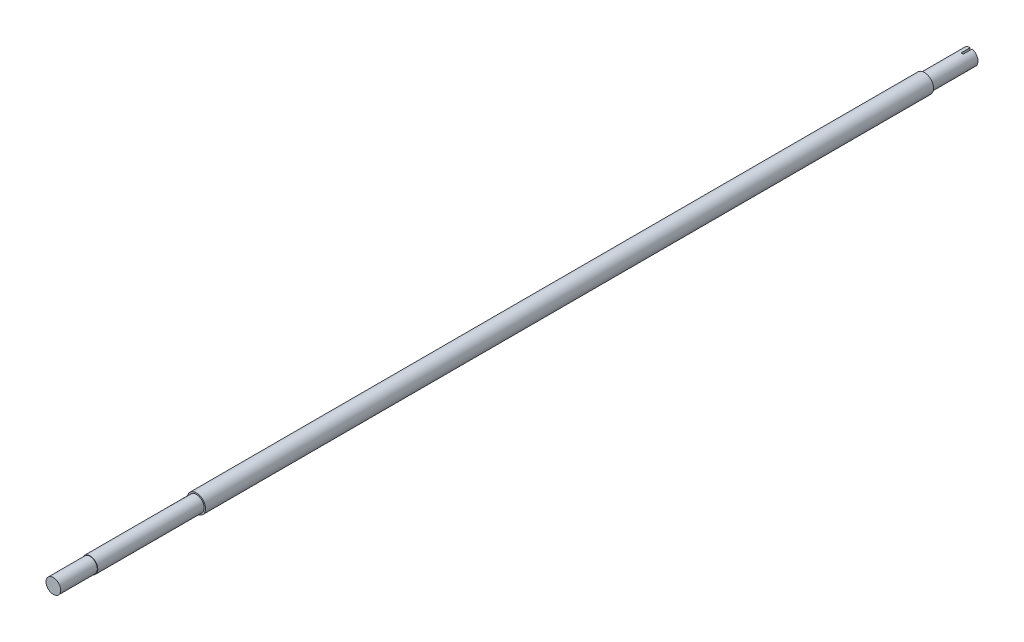
ISO-10303-21;
HEADER;
FILE_DESCRIPTION(('STEP AP214'),'2;1');
FILE_NAME('part.step','',(''),(''),'','','');
FILE_SCHEMA(('AUTOMOTIVE_DESIGN { 1 0 10303 214 1 1 1 1 }'));
ENDSEC;
DATA;
#1=APPLICATION_CONTEXT('core data for automotive mechanical design processes');
#2=APPLICATION_PROTOCOL_DEFINITION('international standard','automotive_design',2000,#1);
#3=PRODUCT_CONTEXT('',#1,'mechanical');
#4=PRODUCT('Part','Part','',(#3));
#5=PRODUCT_RELATED_PRODUCT_CATEGORY('part','',(#4));
#6=PRODUCT_DEFINITION_FORMATION('','',#4);
#7=PRODUCT_DEFINITION_CONTEXT('part definition',#1,'design');
#8=PRODUCT_DEFINITION('design','',#6,#7);
#9=PRODUCT_DEFINITION_SHAPE('','',#8);
#10=(LENGTH_UNIT() NAMED_UNIT(*) SI_UNIT(.MILLI.,.METRE.));
#11=(NAMED_UNIT(*) PLANE_ANGLE_UNIT() SI_UNIT($,.RADIAN.));
#12=(NAMED_UNIT(*) SI_UNIT($,.STERADIAN.) SOLID_ANGLE_UNIT());
#13=UNCERTAINTY_MEASURE_WITH_UNIT(LENGTH_MEASURE(1.E-05),#10,'distance_accuracy_value','');
#14=(GEOMETRIC_REPRESENTATION_CONTEXT(3) GLOBAL_UNCERTAINTY_ASSIGNED_CONTEXT((#13)) GLOBAL_UNIT_ASSIGNED_CONTEXT((#10,
#11,#12)) REPRESENTATION_CONTEXT('',''));
#15=CARTESIAN_POINT('',(0.,0.,0.));
#16=DIRECTION('',(0.,0.,1.));
#17=DIRECTION('',(1.,0.,0.));
#18=AXIS2_PLACEMENT_3D('',#15,#16,#17);
#19=CARTESIAN_POINT('',(0.,0.,844.));
#20=DIRECTION('',(0.,0.,1.));
#21=DIRECTION('',(1.,0.,0.));
#22=AXIS2_PLACEMENT_3D('',#19,#20,#21);
#23=CYLINDRICAL_SURFACE('',#22,8.5);
#24=CARTESIAN_POINT('',(0.,0.,844.));
#25=DIRECTION('',(0.,0.,1.));
#26=DIRECTION('',(1.,0.,0.));
#27=AXIS2_PLACEMENT_3D('',#24,#25,#26);
#28=CIRCLE('',#27,8.5);
#29=CARTESIAN_POINT('',(8.5,0.,844.));
#30=VERTEX_POINT('',#29);
#31=EDGE_CURVE('E130',#30,#30,#28,.T.);
#32=ORIENTED_EDGE('',*,*,#31,.T.);
#33=EDGE_LOOP('',(#32));
#34=FACE_BOUND('',#33,.T.);
#35=CARTESIAN_POINT('',(0.,0.,960.));
#36=DIRECTION('',(0.,0.,1.));
#37=DIRECTION('',(1.,0.,0.));
#38=AXIS2_PLACEMENT_3D('',#35,#36,#37);
#39=CIRCLE('',#38,8.5);
#40=CARTESIAN_POINT('',(8.5,0.,960.));
#41=VERTEX_POINT('',#40);
#42=EDGE_CURVE('E120',#41,#41,#39,.F.);
#43=ORIENTED_EDGE('',*,*,#42,.T.);
#44=EDGE_LOOP('',(#43));
#45=FACE_BOUND('',#44,.T.);
#46=ADVANCED_FACE('F48',(#34,#45),#23,.T.);
#47=CARTESIAN_POINT('',(0.,0.,1000.));
#48=DIRECTION('',(0.,0.,-1.));
#49=DIRECTION('',(-1.,0.,0.));
#50=AXIS2_PLACEMENT_3D('',#47,#48,#49);
#51=CYLINDRICAL_SURFACE('',#50,10.);
#52=CARTESIAN_POINT('',(0.,0.,844.));
#53=DIRECTION('',(0.,0.,1.));
#54=DIRECTION('',(1.,0.,0.));
#55=AXIS2_PLACEMENT_3D('',#52,#53,#54);
#56=CIRCLE('',#55,10.);
#57=CARTESIAN_POINT('',(10.,0.,844.));
#58=VERTEX_POINT('',#57);
#59=EDGE_CURVE('E133',#58,#58,#56,.T.);
#60=ORIENTED_EDGE('',*,*,#59,.F.);
#61=EDGE_LOOP('',(#60));
#62=FACE_BOUND('',#61,.T.);
#63=CARTESIAN_POINT('',(0.,0.,50.));
#64=DIRECTION('',(0.,0.,-1.));
#65=DIRECTION('',(-1.,0.,0.));
#66=AXIS2_PLACEMENT_3D('',#63,#64,#65);
#67=CIRCLE('',#66,10.);
#68=CARTESIAN_POINT('',(-10.,0.,50.));
#69=VERTEX_POINT('',#68);
#70=EDGE_CURVE('E126',#69,#69,#67,.T.);
#71=ORIENTED_EDGE('',*,*,#70,.F.);
#72=EDGE_LOOP('',(#71));
#73=FACE_BOUND('',#72,.T.);
#74=ADVANCED_FACE('F50',(#62,#73),#51,.T.);
#75=CARTESIAN_POINT('',(0.,0.,844.));
#76=DIRECTION('',(0.,0.,1.));
#77=DIRECTION('',(1.,0.,0.));
#78=AXIS2_PLACEMENT_3D('',#75,#76,#77);
#79=PLANE('',#78);
#80=ORIENTED_EDGE('',*,*,#31,.F.);
#81=EDGE_LOOP('',(#80));
#82=FACE_BOUND('',#81,.T.);
#83=ORIENTED_EDGE('',*,*,#59,.T.);
#84=EDGE_LOOP('',(#83));
#85=FACE_BOUND('',#84,.T.);
#86=ADVANCED_FACE('F153',(#82,#85),#79,.T.);
#87=CARTESIAN_POINT('',(0.,0.,50.));
#88=DIRECTION('',(0.,0.,-1.));
#89=DIRECTION('',(-1.,0.,0.));
#90=AXIS2_PLACEMENT_3D('',#87,#88,#89);
#91=PLANE('',#90);
#92=CARTESIAN_POINT('',(0.,0.,50.));
#93=DIRECTION('',(0.,0.,-1.));
#94=DIRECTION('',(-1.,0.,0.));
#95=AXIS2_PLACEMENT_3D('',#92,#93,#94);
#96=CIRCLE('',#95,8.5);
#97=CARTESIAN_POINT('',(-8.5,0.,50.));
#98=VERTEX_POINT('',#97);
#99=EDGE_CURVE('E123',#98,#98,#96,.T.);
#100=ORIENTED_EDGE('',*,*,#99,.F.);
#101=EDGE_LOOP('',(#100));
#102=FACE_BOUND('',#101,.T.);
#103=ORIENTED_EDGE('',*,*,#70,.T.);
#104=EDGE_LOOP('',(#103));
#105=FACE_BOUND('',#104,.T.);
#106=ADVANCED_FACE('F147',(#102,#105),#91,.T.);
#107=CARTESIAN_POINT('',(0.,0.,50.));
#108=DIRECTION('',(0.,0.,-1.));
#109=DIRECTION('',(-1.,0.,0.));
#110=AXIS2_PLACEMENT_3D('',#107,#108,#109);
#111=CYLINDRICAL_SURFACE('',#110,8.5);
#112=DIRECTION('',(0.,0.,-1.));
#113=VECTOR('',#112,1.);
#114=CARTESIAN_POINT('',(0.,8.5,50.));
#115=LINE('',#114,#113);
#116=CARTESIAN_POINT('',(0.,8.5,0.));
#117=VERTEX_POINT('',#116);
#118=CARTESIAN_POINT('',(0.,8.5,10.));
#119=VERTEX_POINT('',#118);
#120=EDGE_CURVE('E71',#117,#119,#115,.F.);
#121=ORIENTED_EDGE('',*,*,#120,.F.);
#122=CARTESIAN_POINT('',(0.,0.,0.));
#123=DIRECTION('',(0.,0.,-1.));
#124=DIRECTION('',(-1.,0.,0.));
#125=AXIS2_PLACEMENT_3D('',#122,#123,#124);
#126=CIRCLE('',#125,8.5);
#127=CARTESIAN_POINT('',(2.14047846583298,8.22607755478304,0.));
#128=VERTEX_POINT('',#127);
#129=EDGE_CURVE('E127',#128,#117,#126,.T.);
#130=ORIENTED_EDGE('',*,*,#129,.F.);
#131=DIRECTION('',(0.,0.,-1.));
#132=VECTOR('',#131,1.);
#133=CARTESIAN_POINT('',(2.14047846583298,8.22607755478304,50.));
#134=LINE('',#133,#132);
#135=CARTESIAN_POINT('',(2.14047846583298,8.22607755478304,10.));
#136=VERTEX_POINT('',#135);
#137=EDGE_CURVE('E63',#136,#128,#134,.T.);
#138=ORIENTED_EDGE('',*,*,#137,.F.);
#139=CARTESIAN_POINT('',(0.,0.,10.));
#140=DIRECTION('',(0.,0.,-1.));
#141=DIRECTION('',(-1.,0.,0.));
#142=AXIS2_PLACEMENT_3D('',#139,#140,#141);
#143=CIRCLE('',#142,8.5);
#144=EDGE_CURVE('E14',#136,#119,#143,.F.);
#145=ORIENTED_EDGE('',*,*,#144,.T.);
#146=EDGE_LOOP('',(#121,#130,#138,#145));
#147=FACE_BOUND('',#146,.T.);
#148=ORIENTED_EDGE('',*,*,#99,.T.);
#149=EDGE_LOOP('',(#148));
#150=FACE_BOUND('',#149,.T.);
#151=ADVANCED_FACE('F144',(#147,#150),#111,.T.);
#152=CARTESIAN_POINT('',(0.,0.,0.));
#153=DIRECTION('',(0.,0.,1.));
#154=DIRECTION('',(1.,0.,0.));
#155=AXIS2_PLACEMENT_3D('',#152,#153,#154);
#156=PLANE('',#155);
#157=ORIENTED_EDGE('',*,*,#129,.T.);
#158=DIRECTION('',(0.,1.,0.));
#159=VECTOR('',#158,1.);
#160=CARTESIAN_POINT('',(0.,0.,0.));
#161=LINE('',#160,#159);
#162=CARTESIAN_POINT('',(0.,0.,0.));
#163=VERTEX_POINT('',#162);
#164=EDGE_CURVE('E109',#163,#117,#161,.T.);
#165=ORIENTED_EDGE('',*,*,#164,.F.);
#166=DIRECTION('',(-1.,0.,0.));
#167=VECTOR('',#166,1.);
#168=CARTESIAN_POINT('',(0.,0.,0.));
#169=LINE('',#168,#167);
#170=CARTESIAN_POINT('',(2.14047846583298,0.,0.));
#171=VERTEX_POINT('',#170);
#172=EDGE_CURVE('E111',#171,#163,#169,.T.);
#173=ORIENTED_EDGE('',*,*,#172,.F.);
#174=DIRECTION('',(0.,1.,0.));
#175=VECTOR('',#174,1.);
#176=CARTESIAN_POINT('',(2.14047846583298,0.,0.));
#177=LINE('',#176,#175);
#178=EDGE_CURVE('E56',#171,#128,#177,.T.);
#179=ORIENTED_EDGE('',*,*,#178,.T.);
#180=EDGE_LOOP('',(#157,#165,#173,#179));
#181=FACE_BOUND('',#180,.T.);
#182=ADVANCED_FACE('F141',(#181),#156,.F.);
#183=CARTESIAN_POINT('',(0.,0.,960.));
#184=DIRECTION('',(0.,0.,1.));
#185=DIRECTION('',(1.,0.,0.));
#186=AXIS2_PLACEMENT_3D('',#183,#184,#185);
#187=PLANE('',#186);
#188=ORIENTED_EDGE('',*,*,#42,.F.);
#189=EDGE_LOOP('',(#188));
#190=FACE_BOUND('',#189,.T.);
#191=CARTESIAN_POINT('',(0.,0.,960.));
#192=DIRECTION('',(0.,0.,1.));
#193=DIRECTION('',(1.,0.,0.));
#194=AXIS2_PLACEMENT_3D('',#191,#192,#193);
#195=CIRCLE('',#194,8.);
#196=CARTESIAN_POINT('',(8.,0.,960.));
#197=VERTEX_POINT('',#196);
#198=EDGE_CURVE('E117',#197,#197,#195,.T.);
#199=ORIENTED_EDGE('',*,*,#198,.F.);
#200=EDGE_LOOP('',(#199));
#201=FACE_BOUND('',#200,.T.);
#202=ADVANCED_FACE('F179',(#190,#201),#187,.T.);
#203=CARTESIAN_POINT('',(0.,0.,960.));
#204=DIRECTION('',(0.,0.,1.));
#205=DIRECTION('',(1.,0.,0.));
#206=AXIS2_PLACEMENT_3D('',#203,#204,#205);
#207=CYLINDRICAL_SURFACE('',#206,8.);
#208=ORIENTED_EDGE('',*,*,#198,.T.);
#209=EDGE_LOOP('',(#208));
#210=FACE_BOUND('',#209,.T.);
#211=CARTESIAN_POINT('',(0.,0.,1000.));
#212=DIRECTION('',(0.,0.,1.));
#213=DIRECTION('',(1.,0.,0.));
#214=AXIS2_PLACEMENT_3D('',#211,#212,#213);
#215=CIRCLE('',#214,8.);
#216=CARTESIAN_POINT('',(8.,0.,1000.));
#217=VERTEX_POINT('',#216);
#218=EDGE_CURVE('E116',#217,#217,#215,.T.);
#219=ORIENTED_EDGE('',*,*,#218,.F.);
#220=EDGE_LOOP('',(#219));
#221=FACE_BOUND('',#220,.T.);
#222=ADVANCED_FACE('F176',(#210,#221),#207,.T.);
#223=CARTESIAN_POINT('',(0.,0.,1000.));
#224=DIRECTION('',(0.,0.,1.));
#225=DIRECTION('',(1.,0.,0.));
#226=AXIS2_PLACEMENT_3D('',#223,#224,#225);
#227=PLANE('',#226);
#228=ORIENTED_EDGE('',*,*,#218,.T.);
#229=EDGE_LOOP('',(#228));
#230=FACE_BOUND('',#229,.T.);
#231=ADVANCED_FACE('F173',(#230),#227,.T.);
#232=CARTESIAN_POINT('',(0.,0.,10.));
#233=DIRECTION('',(-1.,0.,0.));
#234=DIRECTION('',(0.,0.,1.));
#235=AXIS2_PLACEMENT_3D('',#232,#233,#234);
#236=PLANE('',#235);
#237=ORIENTED_EDGE('',*,*,#120,.T.);
#238=DIRECTION('',(0.,1.,0.));
#239=VECTOR('',#238,1.);
#240=CARTESIAN_POINT('',(0.,0.,10.));
#241=LINE('',#240,#239);
#242=CARTESIAN_POINT('',(0.,0.,10.));
#243=VERTEX_POINT('',#242);
#244=EDGE_CURVE('E95',#243,#119,#241,.T.);
#245=ORIENTED_EDGE('',*,*,#244,.F.);
#246=DIRECTION('',(0.,0.,-1.));
#247=VECTOR('',#246,1.);
#248=CARTESIAN_POINT('',(0.,0.,10.));
#249=LINE('',#248,#247);
#250=EDGE_CURVE('E103',#243,#163,#249,.T.);
#251=ORIENTED_EDGE('',*,*,#250,.T.);
#252=ORIENTED_EDGE('',*,*,#164,.T.);
#253=EDGE_LOOP('',(#237,#245,#251,#252));
#254=FACE_BOUND('',#253,.T.);
#255=ADVANCED_FACE('F175',(#254),#236,.F.);
#256=CARTESIAN_POINT('',(0.,0.,10.));
#257=DIRECTION('',(0.,-1.,0.));
#258=DIRECTION('',(0.,0.,-1.));
#259=AXIS2_PLACEMENT_3D('',#256,#257,#258);
#260=PLANE('',#259);
#261=ORIENTED_EDGE('',*,*,#172,.T.);
#262=ORIENTED_EDGE('',*,*,#250,.F.);
#263=DIRECTION('',(-1.,0.,0.));
#264=VECTOR('',#263,1.);
#265=CARTESIAN_POINT('',(0.,0.,10.));
#266=LINE('',#265,#264);
#267=CARTESIAN_POINT('',(2.14047846583298,0.,10.));
#268=VERTEX_POINT('',#267);
#269=EDGE_CURVE('E94',#268,#243,#266,.T.);
#270=ORIENTED_EDGE('',*,*,#269,.F.);
#271=DIRECTION('',(0.,0.,-1.));
#272=VECTOR('',#271,1.);
#273=CARTESIAN_POINT('',(2.14047846583298,0.,10.));
#274=LINE('',#273,#272);
#275=EDGE_CURVE('E98',#268,#171,#274,.T.);
#276=ORIENTED_EDGE('',*,*,#275,.T.);
#277=EDGE_LOOP('',(#261,#262,#270,#276));
#278=FACE_BOUND('',#277,.T.);
#279=ADVANCED_FACE('F105',(#278),#260,.F.);
#280=CARTESIAN_POINT('',(2.14047846583298,0.,10.));
#281=DIRECTION('',(1.,0.,0.));
#282=DIRECTION('',(0.,0.,-1.));
#283=AXIS2_PLACEMENT_3D('',#280,#281,#282);
#284=PLANE('',#283);
#285=ORIENTED_EDGE('',*,*,#137,.T.);
#286=ORIENTED_EDGE('',*,*,#178,.F.);
#287=ORIENTED_EDGE('',*,*,#275,.F.);
#288=DIRECTION('',(0.,-1.,0.));
#289=VECTOR('',#288,1.);
#290=CARTESIAN_POINT('',(2.14047846583298,0.,10.));
#291=LINE('',#290,#289);
#292=EDGE_CURVE('E90',#136,#268,#291,.T.);
#293=ORIENTED_EDGE('',*,*,#292,.F.);
#294=EDGE_LOOP('',(#285,#286,#287,#293));
#295=FACE_BOUND('',#294,.T.);
#296=ADVANCED_FACE('F99',(#295),#284,.F.);
#297=CARTESIAN_POINT('',(0.,0.,10.));
#298=DIRECTION('',(0.,0.,-1.));
#299=DIRECTION('',(-1.,0.,0.));
#300=AXIS2_PLACEMENT_3D('',#297,#298,#299);
#301=PLANE('',#300);
#302=ORIENTED_EDGE('',*,*,#292,.T.);
#303=ORIENTED_EDGE('',*,*,#269,.T.);
#304=ORIENTED_EDGE('',*,*,#244,.T.);
#305=ORIENTED_EDGE('',*,*,#144,.F.);
#306=EDGE_LOOP('',(#302,#303,#304,#305));
#307=FACE_BOUND('',#306,.T.);
#308=ADVANCED_FACE('F92',(#307),#301,.T.);
#309=CLOSED_SHELL('',(#46,#74,#86,#106,#151,#182,#202,#222,#231,#255,#279,#296,#308));
#310=MANIFOLD_SOLID_BREP('B2',#309);
#311=ADVANCED_BREP_SHAPE_REPRESENTATION('',(#18,#310),#14);
#312=SHAPE_DEFINITION_REPRESENTATION(#9,#311);
ENDSEC;
END-ISO-10303-21;
